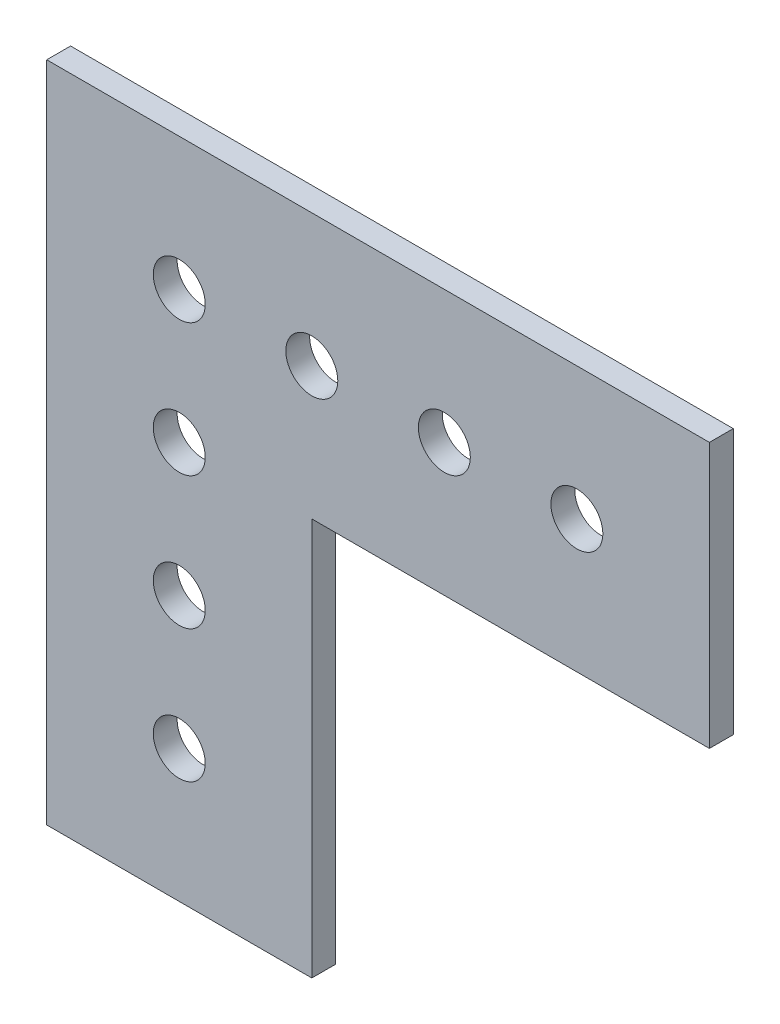
ISO-10303-21;
HEADER;
FILE_DESCRIPTION(('STEP AP214'),'2;1');
FILE_NAME('part.step','',(''),(''),'','','');
FILE_SCHEMA(('AUTOMOTIVE_DESIGN { 1 0 10303 214 1 1 1 1 }'));
ENDSEC;
DATA;
#1=APPLICATION_CONTEXT('core data for automotive mechanical design processes');
#2=APPLICATION_PROTOCOL_DEFINITION('international standard','automotive_design',2000,#1);
#3=PRODUCT_CONTEXT('',#1,'mechanical');
#4=PRODUCT('Part','Part','',(#3));
#5=PRODUCT_RELATED_PRODUCT_CATEGORY('part','',(#4));
#6=PRODUCT_DEFINITION_FORMATION('','',#4);
#7=PRODUCT_DEFINITION_CONTEXT('part definition',#1,'design');
#8=PRODUCT_DEFINITION('design','',#6,#7);
#9=PRODUCT_DEFINITION_SHAPE('','',#8);
#10=(LENGTH_UNIT() NAMED_UNIT(*) SI_UNIT(.MILLI.,.METRE.));
#11=(NAMED_UNIT(*) PLANE_ANGLE_UNIT() SI_UNIT($,.RADIAN.));
#12=(NAMED_UNIT(*) SI_UNIT($,.STERADIAN.) SOLID_ANGLE_UNIT());
#13=UNCERTAINTY_MEASURE_WITH_UNIT(LENGTH_MEASURE(1.E-05),#10,'distance_accuracy_value','');
#14=(GEOMETRIC_REPRESENTATION_CONTEXT(3) GLOBAL_UNCERTAINTY_ASSIGNED_CONTEXT((#13)) GLOBAL_UNIT_ASSIGNED_CONTEXT((#10,
#11,#12)) REPRESENTATION_CONTEXT('',''));
#15=CARTESIAN_POINT('',(0.,0.,0.));
#16=DIRECTION('',(0.,0.,1.));
#17=DIRECTION('',(1.,0.,0.));
#18=AXIS2_PLACEMENT_3D('',#15,#16,#17);
#19=CARTESIAN_POINT('',(50.8,12.7,2.286));
#20=DIRECTION('',(1.,0.,0.));
#21=DIRECTION('',(0.,1.,0.));
#22=AXIS2_PLACEMENT_3D('',#19,#20,#21);
#23=PLANE('',#22);
#24=DIRECTION('',(0.,-1.,0.));
#25=VECTOR('',#24,1.);
#26=CARTESIAN_POINT('',(50.8,12.7,0.));
#27=LINE('',#26,#25);
#28=CARTESIAN_POINT('',(50.8,12.7,0.));
#29=VERTEX_POINT('',#28);
#30=CARTESIAN_POINT('',(50.8,-12.7,0.));
#31=VERTEX_POINT('',#30);
#32=EDGE_CURVE('E120',#29,#31,#27,.T.);
#33=ORIENTED_EDGE('',*,*,#32,.F.);
#34=DIRECTION('',(0.,0.,-1.));
#35=VECTOR('',#34,1.);
#36=CARTESIAN_POINT('',(50.8,12.7,2.286));
#37=LINE('',#36,#35);
#38=CARTESIAN_POINT('',(50.8,12.7,2.286));
#39=VERTEX_POINT('',#38);
#40=EDGE_CURVE('E11',#39,#29,#37,.T.);
#41=ORIENTED_EDGE('',*,*,#40,.F.);
#42=DIRECTION('',(0.,-1.,0.));
#43=VECTOR('',#42,1.);
#44=CARTESIAN_POINT('',(50.8,12.7,2.286));
#45=LINE('',#44,#43);
#46=CARTESIAN_POINT('',(50.8,-12.7,2.286));
#47=VERTEX_POINT('',#46);
#48=EDGE_CURVE('E135',#39,#47,#45,.T.);
#49=ORIENTED_EDGE('',*,*,#48,.T.);
#50=DIRECTION('',(0.,0.,-1.));
#51=VECTOR('',#50,1.);
#52=CARTESIAN_POINT('',(50.8,-12.7,2.286));
#53=LINE('',#52,#51);
#54=EDGE_CURVE('E38',#47,#31,#53,.T.);
#55=ORIENTED_EDGE('',*,*,#54,.T.);
#56=EDGE_LOOP('',(#33,#41,#49,#55));
#57=FACE_BOUND('',#56,.T.);
#58=ADVANCED_FACE('F35',(#57),#23,.T.);
#59=CARTESIAN_POINT('',(-12.7,12.7,2.286));
#60=DIRECTION('',(0.,1.,0.));
#61=DIRECTION('',(-1.,0.,0.));
#62=AXIS2_PLACEMENT_3D('',#59,#60,#61);
#63=PLANE('',#62);
#64=DIRECTION('',(1.,0.,0.));
#65=VECTOR('',#64,1.);
#66=CARTESIAN_POINT('',(-12.7,12.7,0.));
#67=LINE('',#66,#65);
#68=CARTESIAN_POINT('',(-12.7,12.7,0.));
#69=VERTEX_POINT('',#68);
#70=EDGE_CURVE('E133',#69,#29,#67,.T.);
#71=ORIENTED_EDGE('',*,*,#70,.F.);
#72=DIRECTION('',(0.,0.,-1.));
#73=VECTOR('',#72,1.);
#74=CARTESIAN_POINT('',(-12.7,12.7,2.286));
#75=LINE('',#74,#73);
#76=CARTESIAN_POINT('',(-12.7,12.7,2.286));
#77=VERTEX_POINT('',#76);
#78=EDGE_CURVE('E44',#77,#69,#75,.T.);
#79=ORIENTED_EDGE('',*,*,#78,.F.);
#80=DIRECTION('',(1.,0.,0.));
#81=VECTOR('',#80,1.);
#82=CARTESIAN_POINT('',(-12.7,12.7,2.286));
#83=LINE('',#82,#81);
#84=EDGE_CURVE('E110',#77,#39,#83,.T.);
#85=ORIENTED_EDGE('',*,*,#84,.T.);
#86=ORIENTED_EDGE('',*,*,#40,.T.);
#87=EDGE_LOOP('',(#71,#79,#85,#86));
#88=FACE_BOUND('',#87,.T.);
#89=ADVANCED_FACE('F143',(#88),#63,.T.);
#90=CARTESIAN_POINT('',(-12.7,-50.8,2.286));
#91=DIRECTION('',(-1.,0.,0.));
#92=DIRECTION('',(0.,-1.,0.));
#93=AXIS2_PLACEMENT_3D('',#90,#91,#92);
#94=PLANE('',#93);
#95=DIRECTION('',(0.,1.,0.));
#96=VECTOR('',#95,1.);
#97=CARTESIAN_POINT('',(-12.7,-50.8,0.));
#98=LINE('',#97,#96);
#99=CARTESIAN_POINT('',(-12.7,-50.8,0.));
#100=VERTEX_POINT('',#99);
#101=EDGE_CURVE('E97',#100,#69,#98,.T.);
#102=ORIENTED_EDGE('',*,*,#101,.F.);
#103=DIRECTION('',(0.,0.,-1.));
#104=VECTOR('',#103,1.);
#105=CARTESIAN_POINT('',(-12.7,-50.8,2.286));
#106=LINE('',#105,#104);
#107=CARTESIAN_POINT('',(-12.7,-50.8,2.286));
#108=VERTEX_POINT('',#107);
#109=EDGE_CURVE('E92',#108,#100,#106,.T.);
#110=ORIENTED_EDGE('',*,*,#109,.F.);
#111=DIRECTION('',(0.,1.,0.));
#112=VECTOR('',#111,1.);
#113=CARTESIAN_POINT('',(-12.7,-50.8,2.286));
#114=LINE('',#113,#112);
#115=EDGE_CURVE('E95',#108,#77,#114,.T.);
#116=ORIENTED_EDGE('',*,*,#115,.T.);
#117=ORIENTED_EDGE('',*,*,#78,.T.);
#118=EDGE_LOOP('',(#102,#110,#116,#117));
#119=FACE_BOUND('',#118,.T.);
#120=ADVANCED_FACE('F94',(#119),#94,.T.);
#121=CARTESIAN_POINT('',(12.7,-50.8,2.286));
#122=DIRECTION('',(0.,-1.,0.));
#123=DIRECTION('',(0.,0.,-1.));
#124=AXIS2_PLACEMENT_3D('',#121,#122,#123);
#125=PLANE('',#124);
#126=DIRECTION('',(-1.,0.,0.));
#127=VECTOR('',#126,1.);
#128=CARTESIAN_POINT('',(12.7,-50.8,0.));
#129=LINE('',#128,#127);
#130=CARTESIAN_POINT('',(12.7,-50.8,0.));
#131=VERTEX_POINT('',#130);
#132=EDGE_CURVE('E130',#131,#100,#129,.T.);
#133=ORIENTED_EDGE('',*,*,#132,.F.);
#134=DIRECTION('',(0.,0.,-1.));
#135=VECTOR('',#134,1.);
#136=CARTESIAN_POINT('',(12.7,-50.8,2.286));
#137=LINE('',#136,#135);
#138=CARTESIAN_POINT('',(12.7,-50.8,2.286));
#139=VERTEX_POINT('',#138);
#140=EDGE_CURVE('E102',#139,#131,#137,.T.);
#141=ORIENTED_EDGE('',*,*,#140,.F.);
#142=DIRECTION('',(-1.,0.,0.));
#143=VECTOR('',#142,1.);
#144=CARTESIAN_POINT('',(12.7,-50.8,2.286));
#145=LINE('',#144,#143);
#146=EDGE_CURVE('E108',#139,#108,#145,.T.);
#147=ORIENTED_EDGE('',*,*,#146,.T.);
#148=ORIENTED_EDGE('',*,*,#109,.T.);
#149=EDGE_LOOP('',(#133,#141,#147,#148));
#150=FACE_BOUND('',#149,.T.);
#151=ADVANCED_FACE('F112',(#150),#125,.T.);
#152=CARTESIAN_POINT('',(12.7,-12.7,2.286));
#153=DIRECTION('',(1.,0.,0.));
#154=DIRECTION('',(0.,1.,0.));
#155=AXIS2_PLACEMENT_3D('',#152,#153,#154);
#156=PLANE('',#155);
#157=DIRECTION('',(0.,-1.,0.));
#158=VECTOR('',#157,1.);
#159=CARTESIAN_POINT('',(12.7,-12.7,0.));
#160=LINE('',#159,#158);
#161=CARTESIAN_POINT('',(12.7,-12.7,0.));
#162=VERTEX_POINT('',#161);
#163=EDGE_CURVE('E127',#162,#131,#160,.T.);
#164=ORIENTED_EDGE('',*,*,#163,.F.);
#165=DIRECTION('',(0.,0.,-1.));
#166=VECTOR('',#165,1.);
#167=CARTESIAN_POINT('',(12.7,-12.7,2.286));
#168=LINE('',#167,#166);
#169=CARTESIAN_POINT('',(12.7,-12.7,2.286));
#170=VERTEX_POINT('',#169);
#171=EDGE_CURVE('E138',#170,#162,#168,.T.);
#172=ORIENTED_EDGE('',*,*,#171,.F.);
#173=DIRECTION('',(0.,-1.,0.));
#174=VECTOR('',#173,1.);
#175=CARTESIAN_POINT('',(12.7,-12.7,2.286));
#176=LINE('',#175,#174);
#177=EDGE_CURVE('E113',#170,#139,#176,.T.);
#178=ORIENTED_EDGE('',*,*,#177,.T.);
#179=ORIENTED_EDGE('',*,*,#140,.T.);
#180=EDGE_LOOP('',(#164,#172,#178,#179));
#181=FACE_BOUND('',#180,.T.);
#182=ADVANCED_FACE('F156',(#181),#156,.T.);
#183=CARTESIAN_POINT('',(50.8,-12.7,2.286));
#184=DIRECTION('',(0.,-1.,0.));
#185=DIRECTION('',(0.,0.,-1.));
#186=AXIS2_PLACEMENT_3D('',#183,#184,#185);
#187=PLANE('',#186);
#188=DIRECTION('',(-1.,0.,0.));
#189=VECTOR('',#188,1.);
#190=CARTESIAN_POINT('',(50.8,-12.7,0.));
#191=LINE('',#190,#189);
#192=EDGE_CURVE('E123',#31,#162,#191,.T.);
#193=ORIENTED_EDGE('',*,*,#192,.F.);
#194=ORIENTED_EDGE('',*,*,#54,.F.);
#195=DIRECTION('',(-1.,0.,0.));
#196=VECTOR('',#195,1.);
#197=CARTESIAN_POINT('',(50.8,-12.7,2.286));
#198=LINE('',#197,#196);
#199=EDGE_CURVE('E115',#47,#170,#198,.T.);
#200=ORIENTED_EDGE('',*,*,#199,.T.);
#201=ORIENTED_EDGE('',*,*,#171,.T.);
#202=EDGE_LOOP('',(#193,#194,#200,#201));
#203=FACE_BOUND('',#202,.T.);
#204=ADVANCED_FACE('F140',(#203),#187,.T.);
#205=CARTESIAN_POINT('',(0.,0.,2.286));
#206=DIRECTION('',(0.,0.,-1.));
#207=DIRECTION('',(-1.,0.,0.));
#208=AXIS2_PLACEMENT_3D('',#205,#206,#207);
#209=PLANE('',#208);
#210=CARTESIAN_POINT('',(0.,-38.1,2.286));
#211=DIRECTION('',(0.,0.,-1.));
#212=DIRECTION('',(1.,0.,0.));
#213=AXIS2_PLACEMENT_3D('',#210,#211,#212);
#214=CIRCLE('',#213,2.4892);
#215=CARTESIAN_POINT('',(2.4892,-38.1,2.286));
#216=VERTEX_POINT('',#215);
#217=EDGE_CURVE('E202',#216,#216,#214,.T.);
#218=ORIENTED_EDGE('',*,*,#217,.T.);
#219=EDGE_LOOP('',(#218));
#220=FACE_BOUND('',#219,.T.);
#221=CARTESIAN_POINT('',(0.,-12.7,2.286));
#222=DIRECTION('',(0.,0.,-1.));
#223=DIRECTION('',(1.,0.,0.));
#224=AXIS2_PLACEMENT_3D('',#221,#222,#223);
#225=CIRCLE('',#224,2.4892);
#226=CARTESIAN_POINT('',(2.4892,-12.7,2.286));
#227=VERTEX_POINT('',#226);
#228=EDGE_CURVE('E210',#227,#227,#225,.T.);
#229=ORIENTED_EDGE('',*,*,#228,.T.);
#230=EDGE_LOOP('',(#229));
#231=FACE_BOUND('',#230,.T.);
#232=CARTESIAN_POINT('',(25.4,0.,2.286));
#233=DIRECTION('',(0.,0.,-1.));
#234=DIRECTION('',(1.,0.,0.));
#235=AXIS2_PLACEMENT_3D('',#232,#233,#234);
#236=CIRCLE('',#235,2.4892);
#237=CARTESIAN_POINT('',(27.8892,0.,2.286));
#238=VERTEX_POINT('',#237);
#239=EDGE_CURVE('E216',#238,#238,#236,.T.);
#240=ORIENTED_EDGE('',*,*,#239,.T.);
#241=EDGE_LOOP('',(#240));
#242=FACE_BOUND('',#241,.T.);
#243=CARTESIAN_POINT('',(0.,0.,2.286));
#244=DIRECTION('',(0.,0.,-1.));
#245=DIRECTION('',(1.,0.,0.));
#246=AXIS2_PLACEMENT_3D('',#243,#244,#245);
#247=CIRCLE('',#246,2.4892);
#248=CARTESIAN_POINT('',(2.4892,0.,2.286));
#249=VERTEX_POINT('',#248);
#250=EDGE_CURVE('E222',#249,#249,#247,.T.);
#251=ORIENTED_EDGE('',*,*,#250,.T.);
#252=EDGE_LOOP('',(#251));
#253=FACE_BOUND('',#252,.T.);
#254=CARTESIAN_POINT('',(12.7,0.,2.286));
#255=DIRECTION('',(0.,0.,-1.));
#256=DIRECTION('',(1.,0.,0.));
#257=AXIS2_PLACEMENT_3D('',#254,#255,#256);
#258=CIRCLE('',#257,2.4892);
#259=CARTESIAN_POINT('',(15.1892,0.,2.286));
#260=VERTEX_POINT('',#259);
#261=EDGE_CURVE('E228',#260,#260,#258,.T.);
#262=ORIENTED_EDGE('',*,*,#261,.T.);
#263=EDGE_LOOP('',(#262));
#264=FACE_BOUND('',#263,.T.);
#265=CARTESIAN_POINT('',(38.1,0.,2.286));
#266=DIRECTION('',(0.,0.,-1.));
#267=DIRECTION('',(1.,0.,0.));
#268=AXIS2_PLACEMENT_3D('',#265,#266,#267);
#269=CIRCLE('',#268,2.4892);
#270=CARTESIAN_POINT('',(40.5892,0.,2.286));
#271=VERTEX_POINT('',#270);
#272=EDGE_CURVE('E234',#271,#271,#269,.T.);
#273=ORIENTED_EDGE('',*,*,#272,.T.);
#274=EDGE_LOOP('',(#273));
#275=FACE_BOUND('',#274,.T.);
#276=CARTESIAN_POINT('',(0.,-25.4,2.286));
#277=DIRECTION('',(0.,0.,-1.));
#278=DIRECTION('',(1.,0.,0.));
#279=AXIS2_PLACEMENT_3D('',#276,#277,#278);
#280=CIRCLE('',#279,2.4892);
#281=CARTESIAN_POINT('',(2.4892,-25.4,2.286));
#282=VERTEX_POINT('',#281);
#283=EDGE_CURVE('E124',#282,#282,#280,.T.);
#284=ORIENTED_EDGE('',*,*,#283,.T.);
#285=EDGE_LOOP('',(#284));
#286=FACE_BOUND('',#285,.T.);
#287=ORIENTED_EDGE('',*,*,#48,.F.);
#288=ORIENTED_EDGE('',*,*,#84,.F.);
#289=ORIENTED_EDGE('',*,*,#115,.F.);
#290=ORIENTED_EDGE('',*,*,#146,.F.);
#291=ORIENTED_EDGE('',*,*,#177,.F.);
#292=ORIENTED_EDGE('',*,*,#199,.F.);
#293=EDGE_LOOP('',(#287,#288,#289,#290,#291,#292));
#294=FACE_BOUND('',#293,.T.);
#295=ADVANCED_FACE('F106',(#220,#231,#242,#253,#264,#275,#286,#294),#209,.F.);
#296=CARTESIAN_POINT('',(0.,0.,0.));
#297=DIRECTION('',(0.,0.,-1.));
#298=DIRECTION('',(-1.,0.,0.));
#299=AXIS2_PLACEMENT_3D('',#296,#297,#298);
#300=PLANE('',#299);
#301=CARTESIAN_POINT('',(0.,-38.1,0.));
#302=DIRECTION('',(0.,0.,-1.));
#303=DIRECTION('',(1.,0.,0.));
#304=AXIS2_PLACEMENT_3D('',#301,#302,#303);
#305=CIRCLE('',#304,2.4892);
#306=CARTESIAN_POINT('',(2.4892,-38.1,0.));
#307=VERTEX_POINT('',#306);
#308=EDGE_CURVE('E205',#307,#307,#305,.T.);
#309=ORIENTED_EDGE('',*,*,#308,.F.);
#310=EDGE_LOOP('',(#309));
#311=FACE_BOUND('',#310,.T.);
#312=CARTESIAN_POINT('',(0.,-12.7,0.));
#313=DIRECTION('',(0.,0.,-1.));
#314=DIRECTION('',(1.,0.,0.));
#315=AXIS2_PLACEMENT_3D('',#312,#313,#314);
#316=CIRCLE('',#315,2.4892);
#317=CARTESIAN_POINT('',(2.4892,-12.7,0.));
#318=VERTEX_POINT('',#317);
#319=EDGE_CURVE('E207',#318,#318,#316,.T.);
#320=ORIENTED_EDGE('',*,*,#319,.F.);
#321=EDGE_LOOP('',(#320));
#322=FACE_BOUND('',#321,.T.);
#323=CARTESIAN_POINT('',(25.4,0.,0.));
#324=DIRECTION('',(0.,0.,-1.));
#325=DIRECTION('',(1.,0.,0.));
#326=AXIS2_PLACEMENT_3D('',#323,#324,#325);
#327=CIRCLE('',#326,2.4892);
#328=CARTESIAN_POINT('',(27.8892,0.,0.));
#329=VERTEX_POINT('',#328);
#330=EDGE_CURVE('E213',#329,#329,#327,.T.);
#331=ORIENTED_EDGE('',*,*,#330,.F.);
#332=EDGE_LOOP('',(#331));
#333=FACE_BOUND('',#332,.T.);
#334=CARTESIAN_POINT('',(0.,0.,0.));
#335=DIRECTION('',(0.,0.,-1.));
#336=DIRECTION('',(1.,0.,0.));
#337=AXIS2_PLACEMENT_3D('',#334,#335,#336);
#338=CIRCLE('',#337,2.4892);
#339=CARTESIAN_POINT('',(2.4892,0.,0.));
#340=VERTEX_POINT('',#339);
#341=EDGE_CURVE('E219',#340,#340,#338,.T.);
#342=ORIENTED_EDGE('',*,*,#341,.F.);
#343=EDGE_LOOP('',(#342));
#344=FACE_BOUND('',#343,.T.);
#345=CARTESIAN_POINT('',(12.7,0.,0.));
#346=DIRECTION('',(0.,0.,-1.));
#347=DIRECTION('',(1.,0.,0.));
#348=AXIS2_PLACEMENT_3D('',#345,#346,#347);
#349=CIRCLE('',#348,2.4892);
#350=CARTESIAN_POINT('',(15.1892,0.,0.));
#351=VERTEX_POINT('',#350);
#352=EDGE_CURVE('E225',#351,#351,#349,.T.);
#353=ORIENTED_EDGE('',*,*,#352,.F.);
#354=EDGE_LOOP('',(#353));
#355=FACE_BOUND('',#354,.T.);
#356=CARTESIAN_POINT('',(38.1,0.,0.));
#357=DIRECTION('',(0.,0.,-1.));
#358=DIRECTION('',(1.,0.,0.));
#359=AXIS2_PLACEMENT_3D('',#356,#357,#358);
#360=CIRCLE('',#359,2.4892);
#361=CARTESIAN_POINT('',(40.5892,0.,0.));
#362=VERTEX_POINT('',#361);
#363=EDGE_CURVE('E231',#362,#362,#360,.T.);
#364=ORIENTED_EDGE('',*,*,#363,.F.);
#365=EDGE_LOOP('',(#364));
#366=FACE_BOUND('',#365,.T.);
#367=CARTESIAN_POINT('',(0.,-25.4,0.));
#368=DIRECTION('',(0.,0.,-1.));
#369=DIRECTION('',(1.,0.,0.));
#370=AXIS2_PLACEMENT_3D('',#367,#368,#369);
#371=CIRCLE('',#370,2.4892);
#372=CARTESIAN_POINT('',(2.4892,-25.4,0.));
#373=VERTEX_POINT('',#372);
#374=EDGE_CURVE('E237',#373,#373,#371,.T.);
#375=ORIENTED_EDGE('',*,*,#374,.F.);
#376=EDGE_LOOP('',(#375));
#377=FACE_BOUND('',#376,.T.);
#378=ORIENTED_EDGE('',*,*,#32,.T.);
#379=ORIENTED_EDGE('',*,*,#192,.T.);
#380=ORIENTED_EDGE('',*,*,#163,.T.);
#381=ORIENTED_EDGE('',*,*,#132,.T.);
#382=ORIENTED_EDGE('',*,*,#101,.T.);
#383=ORIENTED_EDGE('',*,*,#70,.T.);
#384=EDGE_LOOP('',(#378,#379,#380,#381,#382,#383));
#385=FACE_BOUND('',#384,.T.);
#386=ADVANCED_FACE('F142',(#311,#322,#333,#344,#355,#366,#377,#385),#300,.T.);
#387=CARTESIAN_POINT('',(0.,-25.4,2.286));
#388=DIRECTION('',(0.,0.,-1.));
#389=DIRECTION('',(-1.,0.,0.));
#390=AXIS2_PLACEMENT_3D('',#387,#388,#389);
#391=CYLINDRICAL_SURFACE('',#390,2.4892);
#392=ORIENTED_EDGE('',*,*,#283,.F.);
#393=EDGE_LOOP('',(#392));
#394=FACE_BOUND('',#393,.T.);
#395=ORIENTED_EDGE('',*,*,#374,.T.);
#396=EDGE_LOOP('',(#395));
#397=FACE_BOUND('',#396,.T.);
#398=ADVANCED_FACE('F167',(#394,#397),#391,.F.);
#399=CARTESIAN_POINT('',(38.1,0.,2.286));
#400=DIRECTION('',(0.,0.,-1.));
#401=DIRECTION('',(-1.,0.,0.));
#402=AXIS2_PLACEMENT_3D('',#399,#400,#401);
#403=CYLINDRICAL_SURFACE('',#402,2.4892);
#404=ORIENTED_EDGE('',*,*,#272,.F.);
#405=EDGE_LOOP('',(#404));
#406=FACE_BOUND('',#405,.T.);
#407=ORIENTED_EDGE('',*,*,#363,.T.);
#408=EDGE_LOOP('',(#407));
#409=FACE_BOUND('',#408,.T.);
#410=ADVANCED_FACE('F174',(#406,#409),#403,.F.);
#411=CARTESIAN_POINT('',(12.7,0.,2.286));
#412=DIRECTION('',(0.,0.,-1.));
#413=DIRECTION('',(-1.,0.,0.));
#414=AXIS2_PLACEMENT_3D('',#411,#412,#413);
#415=CYLINDRICAL_SURFACE('',#414,2.4892);
#416=ORIENTED_EDGE('',*,*,#261,.F.);
#417=EDGE_LOOP('',(#416));
#418=FACE_BOUND('',#417,.T.);
#419=ORIENTED_EDGE('',*,*,#352,.T.);
#420=EDGE_LOOP('',(#419));
#421=FACE_BOUND('',#420,.T.);
#422=ADVANCED_FACE('F178',(#418,#421),#415,.F.);
#423=CARTESIAN_POINT('',(0.,0.,2.286));
#424=DIRECTION('',(0.,0.,-1.));
#425=DIRECTION('',(-1.,0.,0.));
#426=AXIS2_PLACEMENT_3D('',#423,#424,#425);
#427=CYLINDRICAL_SURFACE('',#426,2.4892);
#428=ORIENTED_EDGE('',*,*,#250,.F.);
#429=EDGE_LOOP('',(#428));
#430=FACE_BOUND('',#429,.T.);
#431=ORIENTED_EDGE('',*,*,#341,.T.);
#432=EDGE_LOOP('',(#431));
#433=FACE_BOUND('',#432,.T.);
#434=ADVANCED_FACE('F182',(#430,#433),#427,.F.);
#435=CARTESIAN_POINT('',(25.4,0.,2.286));
#436=DIRECTION('',(0.,0.,-1.));
#437=DIRECTION('',(-1.,0.,0.));
#438=AXIS2_PLACEMENT_3D('',#435,#436,#437);
#439=CYLINDRICAL_SURFACE('',#438,2.4892);
#440=ORIENTED_EDGE('',*,*,#239,.F.);
#441=EDGE_LOOP('',(#440));
#442=FACE_BOUND('',#441,.T.);
#443=ORIENTED_EDGE('',*,*,#330,.T.);
#444=EDGE_LOOP('',(#443));
#445=FACE_BOUND('',#444,.T.);
#446=ADVANCED_FACE('F186',(#442,#445),#439,.F.);
#447=CARTESIAN_POINT('',(0.,-12.7,2.286));
#448=DIRECTION('',(0.,0.,-1.));
#449=DIRECTION('',(-1.,0.,0.));
#450=AXIS2_PLACEMENT_3D('',#447,#448,#449);
#451=CYLINDRICAL_SURFACE('',#450,2.4892);
#452=ORIENTED_EDGE('',*,*,#228,.F.);
#453=EDGE_LOOP('',(#452));
#454=FACE_BOUND('',#453,.T.);
#455=ORIENTED_EDGE('',*,*,#319,.T.);
#456=EDGE_LOOP('',(#455));
#457=FACE_BOUND('',#456,.T.);
#458=ADVANCED_FACE('F190',(#454,#457),#451,.F.);
#459=CARTESIAN_POINT('',(0.,-38.1,2.286));
#460=DIRECTION('',(0.,0.,-1.));
#461=DIRECTION('',(-1.,0.,0.));
#462=AXIS2_PLACEMENT_3D('',#459,#460,#461);
#463=CYLINDRICAL_SURFACE('',#462,2.4892);
#464=ORIENTED_EDGE('',*,*,#217,.F.);
#465=EDGE_LOOP('',(#464));
#466=FACE_BOUND('',#465,.T.);
#467=ORIENTED_EDGE('',*,*,#308,.T.);
#468=EDGE_LOOP('',(#467));
#469=FACE_BOUND('',#468,.T.);
#470=ADVANCED_FACE('F194',(#466,#469),#463,.F.);
#471=CLOSED_SHELL('',(#58,#89,#120,#151,#182,#204,#295,#386,#398,#410,#422,#434,#446,#458,#470));
#472=MANIFOLD_SOLID_BREP('B2',#471);
#473=ADVANCED_BREP_SHAPE_REPRESENTATION('',(#18,#472),#14);
#474=SHAPE_DEFINITION_REPRESENTATION(#9,#473);
ENDSEC;
END-ISO-10303-21;
